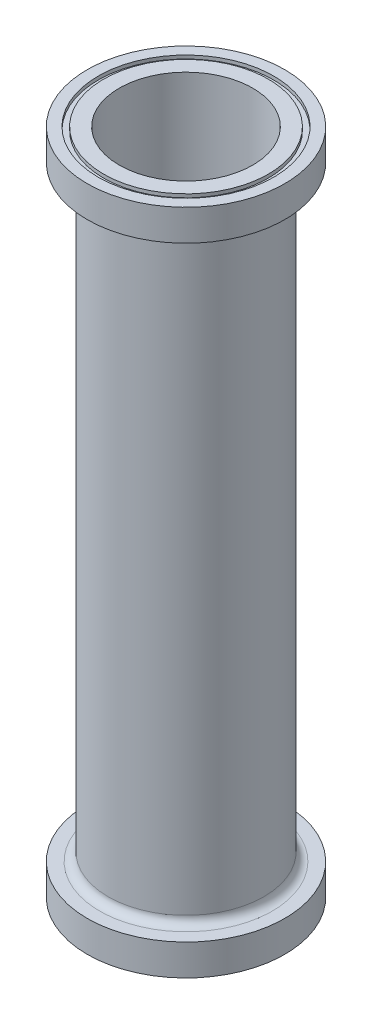
ISO-10303-21;
HEADER;
FILE_DESCRIPTION(('STEP AP214'),'2;1');
FILE_NAME('part.step','',(''),(''),'','','');
FILE_SCHEMA(('AUTOMOTIVE_DESIGN { 1 0 10303 214 1 1 1 1 }'));
ENDSEC;
DATA;
#1=APPLICATION_CONTEXT('core data for automotive mechanical design processes');
#2=APPLICATION_PROTOCOL_DEFINITION('international standard','automotive_design',2000,#1);
#3=PRODUCT_CONTEXT('',#1,'mechanical');
#4=PRODUCT('Part','Part','',(#3));
#5=PRODUCT_RELATED_PRODUCT_CATEGORY('part','',(#4));
#6=PRODUCT_DEFINITION_FORMATION('','',#4);
#7=PRODUCT_DEFINITION_CONTEXT('part definition',#1,'design');
#8=PRODUCT_DEFINITION('design','',#6,#7);
#9=PRODUCT_DEFINITION_SHAPE('','',#8);
#10=(LENGTH_UNIT() NAMED_UNIT(*) SI_UNIT(.MILLI.,.METRE.));
#11=(NAMED_UNIT(*) PLANE_ANGLE_UNIT() SI_UNIT($,.RADIAN.));
#12=(NAMED_UNIT(*) SI_UNIT($,.STERADIAN.) SOLID_ANGLE_UNIT());
#13=UNCERTAINTY_MEASURE_WITH_UNIT(LENGTH_MEASURE(1.E-05),#10,'distance_accuracy_value','');
#14=(GEOMETRIC_REPRESENTATION_CONTEXT(3) GLOBAL_UNCERTAINTY_ASSIGNED_CONTEXT((#13)) GLOBAL_UNIT_ASSIGNED_CONTEXT((#10,
#11,#12)) REPRESENTATION_CONTEXT('',''));
#15=CARTESIAN_POINT('',(0.,0.,0.));
#16=DIRECTION('',(0.,0.,1.));
#17=DIRECTION('',(1.,0.,0.));
#18=AXIS2_PLACEMENT_3D('',#15,#16,#17);
#19=CARTESIAN_POINT('',(0.,381.,0.));
#20=DIRECTION('',(0.,1.,0.));
#21=DIRECTION('',(0.,0.,1.));
#22=AXIS2_PLACEMENT_3D('',#19,#20,#21);
#23=PLANE('',#22);
#24=CARTESIAN_POINT('',(0.,381.,0.));
#25=DIRECTION('',(0.,1.,0.));
#26=DIRECTION('',(0.,0.,1.));
#27=AXIS2_PLACEMENT_3D('',#24,#25,#26);
#28=CIRCLE('',#27,38.1);
#29=CARTESIAN_POINT('',(0.,381.,38.1));
#30=VERTEX_POINT('',#29);
#31=EDGE_CURVE('E57',#30,#30,#28,.T.);
#32=ORIENTED_EDGE('',*,*,#31,.F.);
#33=EDGE_LOOP('',(#32));
#34=FACE_BOUND('',#33,.T.);
#35=CARTESIAN_POINT('',(0.,381.,0.));
#36=DIRECTION('',(0.,1.,0.));
#37=DIRECTION('',(0.,0.,1.));
#38=AXIS2_PLACEMENT_3D('',#35,#36,#37);
#39=CIRCLE('',#38,47.0027);
#40=CARTESIAN_POINT('',(0.,381.,47.0027));
#41=VERTEX_POINT('',#40);
#42=EDGE_CURVE('E94',#41,#41,#39,.T.);
#43=ORIENTED_EDGE('',*,*,#42,.T.);
#44=EDGE_LOOP('',(#43));
#45=FACE_BOUND('',#44,.T.);
#46=ADVANCED_FACE('F37',(#34,#45),#23,.T.);
#47=CARTESIAN_POINT('',(0.,0.,0.));
#48=DIRECTION('',(0.,1.,0.));
#49=DIRECTION('',(0.,0.,1.));
#50=AXIS2_PLACEMENT_3D('',#47,#48,#49);
#51=PLANE('',#50);
#52=CARTESIAN_POINT('',(0.,0.,0.));
#53=DIRECTION('',(0.,1.,0.));
#54=DIRECTION('',(0.,0.,1.));
#55=AXIS2_PLACEMENT_3D('',#52,#53,#54);
#56=CIRCLE('',#55,38.1);
#57=CARTESIAN_POINT('',(0.,0.,38.1));
#58=VERTEX_POINT('',#57);
#59=EDGE_CURVE('E58',#58,#58,#56,.T.);
#60=ORIENTED_EDGE('',*,*,#59,.T.);
#61=EDGE_LOOP('',(#60));
#62=FACE_BOUND('',#61,.T.);
#63=CARTESIAN_POINT('',(0.,0.,0.));
#64=DIRECTION('',(0.,-1.,0.));
#65=DIRECTION('',(0.,0.,-1.));
#66=AXIS2_PLACEMENT_3D('',#63,#64,#65);
#67=CIRCLE('',#66,47.0027);
#68=CARTESIAN_POINT('',(0.,0.,-47.0027));
#69=VERTEX_POINT('',#68);
#70=EDGE_CURVE('E82',#69,#69,#67,.T.);
#71=ORIENTED_EDGE('',*,*,#70,.T.);
#72=EDGE_LOOP('',(#71));
#73=FACE_BOUND('',#72,.T.);
#74=ADVANCED_FACE('F140',(#62,#73),#51,.F.);
#75=CARTESIAN_POINT('',(0.,381.,0.));
#76=DIRECTION('',(0.,-1.,0.));
#77=DIRECTION('',(0.,0.,-1.));
#78=AXIS2_PLACEMENT_3D('',#75,#76,#77);
#79=CYLINDRICAL_SURFACE('',#78,44.45);
#80=CARTESIAN_POINT('',(0.,22.5425,0.));
#81=DIRECTION('',(0.,-1.,0.));
#82=DIRECTION('',(0.,0.,-1.));
#83=AXIS2_PLACEMENT_3D('',#80,#81,#82);
#84=CIRCLE('',#83,44.45);
#85=CARTESIAN_POINT('',(0.,22.5425,-44.45));
#86=VERTEX_POINT('',#85);
#87=EDGE_CURVE('E44',#86,#86,#84,.F.);
#88=ORIENTED_EDGE('',*,*,#87,.T.);
#89=EDGE_LOOP('',(#88));
#90=FACE_BOUND('',#89,.T.);
#91=CARTESIAN_POINT('',(0.,358.4575,0.));
#92=DIRECTION('',(0.,1.,0.));
#93=DIRECTION('',(0.,0.,1.));
#94=AXIS2_PLACEMENT_3D('',#91,#92,#93);
#95=CIRCLE('',#94,44.45);
#96=CARTESIAN_POINT('',(0.,358.4575,44.45));
#97=VERTEX_POINT('',#96);
#98=EDGE_CURVE('E48',#97,#97,#95,.F.);
#99=ORIENTED_EDGE('',*,*,#98,.T.);
#100=EDGE_LOOP('',(#99));
#101=FACE_BOUND('',#100,.T.);
#102=ADVANCED_FACE('F120',(#90,#101),#79,.T.);
#103=CARTESIAN_POINT('',(0.,381.,0.));
#104=DIRECTION('',(0.,1.,0.));
#105=DIRECTION('',(0.,0.,1.));
#106=AXIS2_PLACEMENT_3D('',#103,#104,#105);
#107=CIRCLE('',#106,50.0761);
#108=CARTESIAN_POINT('',(0.,381.,50.0761));
#109=VERTEX_POINT('',#108);
#110=EDGE_CURVE('E88',#109,#109,#107,.T.);
#111=ORIENTED_EDGE('',*,*,#110,.F.);
#112=EDGE_LOOP('',(#111));
#113=FACE_BOUND('',#112,.T.);
#114=CARTESIAN_POINT('',(0.,381.,0.));
#115=DIRECTION('',(0.,1.,0.));
#116=DIRECTION('',(0.,0.,1.));
#117=AXIS2_PLACEMENT_3D('',#114,#115,#116);
#118=CIRCLE('',#117,56.388);
#119=CARTESIAN_POINT('',(0.,381.,56.388));
#120=VERTEX_POINT('',#119);
#121=EDGE_CURVE('E70',#120,#120,#118,.T.);
#122=ORIENTED_EDGE('',*,*,#121,.T.);
#123=EDGE_LOOP('',(#122));
#124=FACE_BOUND('',#123,.T.);
#125=ADVANCED_FACE('F116',(#113,#124),#23,.T.);
#126=CARTESIAN_POINT('',(0.,0.,0.));
#127=DIRECTION('',(0.,-1.,0.));
#128=DIRECTION('',(0.,0.,-1.));
#129=AXIS2_PLACEMENT_3D('',#126,#127,#128);
#130=CIRCLE('',#129,50.0761);
#131=CARTESIAN_POINT('',(0.,0.,-50.0761));
#132=VERTEX_POINT('',#131);
#133=EDGE_CURVE('E76',#132,#132,#130,.T.);
#134=ORIENTED_EDGE('',*,*,#133,.F.);
#135=EDGE_LOOP('',(#134));
#136=FACE_BOUND('',#135,.T.);
#137=CARTESIAN_POINT('',(0.,0.,0.));
#138=DIRECTION('',(0.,-1.,0.));
#139=DIRECTION('',(0.,0.,-1.));
#140=AXIS2_PLACEMENT_3D('',#137,#138,#139);
#141=CIRCLE('',#140,56.388);
#142=CARTESIAN_POINT('',(0.,0.,-56.388));
#143=VERTEX_POINT('',#142);
#144=EDGE_CURVE('E64',#143,#143,#141,.T.);
#145=ORIENTED_EDGE('',*,*,#144,.T.);
#146=EDGE_LOOP('',(#145));
#147=FACE_BOUND('',#146,.T.);
#148=ADVANCED_FACE('F119',(#136,#147),#51,.F.);
#149=CARTESIAN_POINT('',(0.,381.,0.));
#150=DIRECTION('',(0.,-1.,0.));
#151=DIRECTION('',(0.,0.,-1.));
#152=AXIS2_PLACEMENT_3D('',#149,#150,#151);
#153=CYLINDRICAL_SURFACE('',#152,38.1);
#154=ORIENTED_EDGE('',*,*,#31,.T.);
#155=EDGE_LOOP('',(#154));
#156=FACE_BOUND('',#155,.T.);
#157=ORIENTED_EDGE('',*,*,#59,.F.);
#158=EDGE_LOOP('',(#157));
#159=FACE_BOUND('',#158,.T.);
#160=ADVANCED_FACE('F150',(#156,#159),#153,.F.);
#161=CARTESIAN_POINT('',(0.,17.78,0.));
#162=DIRECTION('',(0.,-1.,0.));
#163=DIRECTION('',(0.,0.,-1.));
#164=AXIS2_PLACEMENT_3D('',#161,#162,#163);
#165=CYLINDRICAL_SURFACE('',#164,56.388);
#166=CARTESIAN_POINT('',(0.,17.78,0.));
#167=DIRECTION('',(0.,-1.,0.));
#168=DIRECTION('',(0.,0.,-1.));
#169=AXIS2_PLACEMENT_3D('',#166,#167,#168);
#170=CIRCLE('',#169,56.388);
#171=CARTESIAN_POINT('',(0.,17.78,-56.388));
#172=VERTEX_POINT('',#171);
#173=EDGE_CURVE('E61',#172,#172,#170,.T.);
#174=ORIENTED_EDGE('',*,*,#173,.T.);
#175=EDGE_LOOP('',(#174));
#176=FACE_BOUND('',#175,.T.);
#177=ORIENTED_EDGE('',*,*,#144,.F.);
#178=EDGE_LOOP('',(#177));
#179=FACE_BOUND('',#178,.T.);
#180=ADVANCED_FACE('F136',(#176,#179),#165,.T.);
#181=CARTESIAN_POINT('',(0.,17.78,0.));
#182=DIRECTION('',(0.,-1.,0.));
#183=DIRECTION('',(0.,0.,-1.));
#184=AXIS2_PLACEMENT_3D('',#181,#182,#183);
#185=PLANE('',#184);
#186=CARTESIAN_POINT('',(0.,17.78,0.));
#187=DIRECTION('',(0.,-1.,0.));
#188=DIRECTION('',(0.,0.,-1.));
#189=AXIS2_PLACEMENT_3D('',#186,#187,#188);
#190=CIRCLE('',#189,49.2125);
#191=CARTESIAN_POINT('',(0.,17.78,-49.2125));
#192=VERTEX_POINT('',#191);
#193=EDGE_CURVE('E52',#192,#192,#190,.T.);
#194=ORIENTED_EDGE('',*,*,#193,.T.);
#195=EDGE_LOOP('',(#194));
#196=FACE_BOUND('',#195,.T.);
#197=ORIENTED_EDGE('',*,*,#173,.F.);
#198=EDGE_LOOP('',(#197));
#199=FACE_BOUND('',#198,.T.);
#200=ADVANCED_FACE('F127',(#196,#199),#185,.F.);
#201=CARTESIAN_POINT('',(0.,363.22,0.));
#202=DIRECTION('',(0.,1.,0.));
#203=DIRECTION('',(0.,0.,1.));
#204=AXIS2_PLACEMENT_3D('',#201,#202,#203);
#205=CYLINDRICAL_SURFACE('',#204,56.388);
#206=CARTESIAN_POINT('',(0.,363.22,0.));
#207=DIRECTION('',(0.,1.,0.));
#208=DIRECTION('',(0.,0.,1.));
#209=AXIS2_PLACEMENT_3D('',#206,#207,#208);
#210=CIRCLE('',#209,56.388);
#211=CARTESIAN_POINT('',(0.,363.22,56.388));
#212=VERTEX_POINT('',#211);
#213=EDGE_CURVE('E67',#212,#212,#210,.T.);
#214=ORIENTED_EDGE('',*,*,#213,.T.);
#215=EDGE_LOOP('',(#214));
#216=FACE_BOUND('',#215,.T.);
#217=ORIENTED_EDGE('',*,*,#121,.F.);
#218=EDGE_LOOP('',(#217));
#219=FACE_BOUND('',#218,.T.);
#220=ADVANCED_FACE('F124',(#216,#219),#205,.T.);
#221=CARTESIAN_POINT('',(0.,363.22,0.));
#222=DIRECTION('',(0.,1.,0.));
#223=DIRECTION('',(0.,0.,1.));
#224=AXIS2_PLACEMENT_3D('',#221,#222,#223);
#225=PLANE('',#224);
#226=CARTESIAN_POINT('',(0.,363.22,0.));
#227=DIRECTION('',(0.,1.,0.));
#228=DIRECTION('',(0.,0.,1.));
#229=AXIS2_PLACEMENT_3D('',#226,#227,#228);
#230=CIRCLE('',#229,49.2125);
#231=CARTESIAN_POINT('',(0.,363.22,49.2125));
#232=VERTEX_POINT('',#231);
#233=EDGE_CURVE('E10',#232,#232,#230,.T.);
#234=ORIENTED_EDGE('',*,*,#233,.T.);
#235=EDGE_LOOP('',(#234));
#236=FACE_BOUND('',#235,.T.);
#237=ORIENTED_EDGE('',*,*,#213,.F.);
#238=EDGE_LOOP('',(#237));
#239=FACE_BOUND('',#238,.T.);
#240=ADVANCED_FACE('F126',(#236,#239),#225,.F.);
#241=CARTESIAN_POINT('',(0.,1.9812,0.));
#242=DIRECTION('',(0.,-1.,0.));
#243=DIRECTION('',(0.,0.,-1.));
#244=AXIS2_PLACEMENT_3D('',#241,#242,#243);
#245=CYLINDRICAL_SURFACE('',#244,50.0761);
#246=CARTESIAN_POINT('',(0.,1.9812,0.));
#247=DIRECTION('',(0.,-1.,0.));
#248=DIRECTION('',(0.,0.,-1.));
#249=AXIS2_PLACEMENT_3D('',#246,#247,#248);
#250=CIRCLE('',#249,50.0761);
#251=CARTESIAN_POINT('',(0.,1.9812,-50.0761));
#252=VERTEX_POINT('',#251);
#253=EDGE_CURVE('E73',#252,#252,#250,.T.);
#254=ORIENTED_EDGE('',*,*,#253,.F.);
#255=EDGE_LOOP('',(#254));
#256=FACE_BOUND('',#255,.T.);
#257=ORIENTED_EDGE('',*,*,#133,.T.);
#258=EDGE_LOOP('',(#257));
#259=FACE_BOUND('',#258,.T.);
#260=ADVANCED_FACE('F134',(#256,#259),#245,.F.);
#261=CARTESIAN_POINT('',(0.,1.9812,0.));
#262=DIRECTION('',(0.,-1.,0.));
#263=DIRECTION('',(0.,0.,-1.));
#264=AXIS2_PLACEMENT_3D('',#261,#262,#263);
#265=PLANE('',#264);
#266=CARTESIAN_POINT('',(0.,1.9812,0.));
#267=DIRECTION('',(0.,-1.,0.));
#268=DIRECTION('',(0.,0.,-1.));
#269=AXIS2_PLACEMENT_3D('',#266,#267,#268);
#270=CIRCLE('',#269,47.0027);
#271=CARTESIAN_POINT('',(0.,1.9812,-47.0027));
#272=VERTEX_POINT('',#271);
#273=EDGE_CURVE('E79',#272,#272,#270,.T.);
#274=ORIENTED_EDGE('',*,*,#273,.F.);
#275=EDGE_LOOP('',(#274));
#276=FACE_BOUND('',#275,.T.);
#277=ORIENTED_EDGE('',*,*,#253,.T.);
#278=EDGE_LOOP('',(#277));
#279=FACE_BOUND('',#278,.T.);
#280=ADVANCED_FACE('F186',(#276,#279),#265,.T.);
#281=CARTESIAN_POINT('',(0.,1.9812,0.));
#282=DIRECTION('',(0.,-1.,0.));
#283=DIRECTION('',(0.,0.,-1.));
#284=AXIS2_PLACEMENT_3D('',#281,#282,#283);
#285=CYLINDRICAL_SURFACE('',#284,47.0027);
#286=ORIENTED_EDGE('',*,*,#273,.T.);
#287=EDGE_LOOP('',(#286));
#288=FACE_BOUND('',#287,.T.);
#289=ORIENTED_EDGE('',*,*,#70,.F.);
#290=EDGE_LOOP('',(#289));
#291=FACE_BOUND('',#290,.T.);
#292=ADVANCED_FACE('F112',(#288,#291),#285,.T.);
#293=CARTESIAN_POINT('',(0.,379.0188,0.));
#294=DIRECTION('',(0.,1.,0.));
#295=DIRECTION('',(0.,0.,1.));
#296=AXIS2_PLACEMENT_3D('',#293,#294,#295);
#297=CYLINDRICAL_SURFACE('',#296,50.0761);
#298=CARTESIAN_POINT('',(0.,379.0188,0.));
#299=DIRECTION('',(0.,1.,0.));
#300=DIRECTION('',(0.,0.,1.));
#301=AXIS2_PLACEMENT_3D('',#298,#299,#300);
#302=CIRCLE('',#301,50.0761);
#303=CARTESIAN_POINT('',(0.,379.0188,50.0761));
#304=VERTEX_POINT('',#303);
#305=EDGE_CURVE('E85',#304,#304,#302,.T.);
#306=ORIENTED_EDGE('',*,*,#305,.F.);
#307=EDGE_LOOP('',(#306));
#308=FACE_BOUND('',#307,.T.);
#309=ORIENTED_EDGE('',*,*,#110,.T.);
#310=EDGE_LOOP('',(#309));
#311=FACE_BOUND('',#310,.T.);
#312=ADVANCED_FACE('F106',(#308,#311),#297,.F.);
#313=CARTESIAN_POINT('',(0.,379.0188,0.));
#314=DIRECTION('',(0.,1.,0.));
#315=DIRECTION('',(0.,0.,1.));
#316=AXIS2_PLACEMENT_3D('',#313,#314,#315);
#317=PLANE('',#316);
#318=CARTESIAN_POINT('',(0.,379.0188,0.));
#319=DIRECTION('',(0.,1.,0.));
#320=DIRECTION('',(0.,0.,1.));
#321=AXIS2_PLACEMENT_3D('',#318,#319,#320);
#322=CIRCLE('',#321,47.0027);
#323=CARTESIAN_POINT('',(0.,379.0188,47.0027));
#324=VERTEX_POINT('',#323);
#325=EDGE_CURVE('E91',#324,#324,#322,.T.);
#326=ORIENTED_EDGE('',*,*,#325,.F.);
#327=EDGE_LOOP('',(#326));
#328=FACE_BOUND('',#327,.T.);
#329=ORIENTED_EDGE('',*,*,#305,.T.);
#330=EDGE_LOOP('',(#329));
#331=FACE_BOUND('',#330,.T.);
#332=ADVANCED_FACE('F103',(#328,#331),#317,.T.);
#333=CARTESIAN_POINT('',(0.,379.0188,0.));
#334=DIRECTION('',(0.,1.,0.));
#335=DIRECTION('',(0.,0.,1.));
#336=AXIS2_PLACEMENT_3D('',#333,#334,#335);
#337=CYLINDRICAL_SURFACE('',#336,47.0027);
#338=ORIENTED_EDGE('',*,*,#325,.T.);
#339=EDGE_LOOP('',(#338));
#340=FACE_BOUND('',#339,.T.);
#341=ORIENTED_EDGE('',*,*,#42,.F.);
#342=EDGE_LOOP('',(#341));
#343=FACE_BOUND('',#342,.T.);
#344=ADVANCED_FACE('F100',(#340,#343),#337,.T.);
#345=CARTESIAN_POINT('',(0.,22.5425,0.));
#346=DIRECTION('',(0.,-1.,0.));
#347=DIRECTION('',(0.,0.,-1.));
#348=AXIS2_PLACEMENT_3D('',#345,#346,#347);
#349=TOROIDAL_SURFACE('',#348,49.2125,4.7625);
#350=ORIENTED_EDGE('',*,*,#87,.F.);
#351=EDGE_LOOP('',(#350));
#352=FACE_BOUND('',#351,.T.);
#353=ORIENTED_EDGE('',*,*,#193,.F.);
#354=EDGE_LOOP('',(#353));
#355=FACE_BOUND('',#354,.T.);
#356=ADVANCED_FACE('F156',(#352,#355),#349,.F.);
#357=CARTESIAN_POINT('',(0.,358.4575,0.));
#358=DIRECTION('',(0.,1.,0.));
#359=DIRECTION('',(0.,0.,1.));
#360=AXIS2_PLACEMENT_3D('',#357,#358,#359);
#361=TOROIDAL_SURFACE('',#360,49.2125,4.7625);
#362=ORIENTED_EDGE('',*,*,#98,.F.);
#363=EDGE_LOOP('',(#362));
#364=FACE_BOUND('',#363,.T.);
#365=ORIENTED_EDGE('',*,*,#233,.F.);
#366=EDGE_LOOP('',(#365));
#367=FACE_BOUND('',#366,.T.);
#368=ADVANCED_FACE('F39',(#364,#367),#361,.F.);
#369=CLOSED_SHELL('',(#46,#74,#102,#125,#148,#160,#180,#200,#220,#240,#260,#280,#292,#312,#332,
#344,#356,#368));
#370=MANIFOLD_SOLID_BREP('B2',#369);
#371=ADVANCED_BREP_SHAPE_REPRESENTATION('',(#18,#370),#14);
#372=SHAPE_DEFINITION_REPRESENTATION(#9,#371);
ENDSEC;
END-ISO-10303-21;
